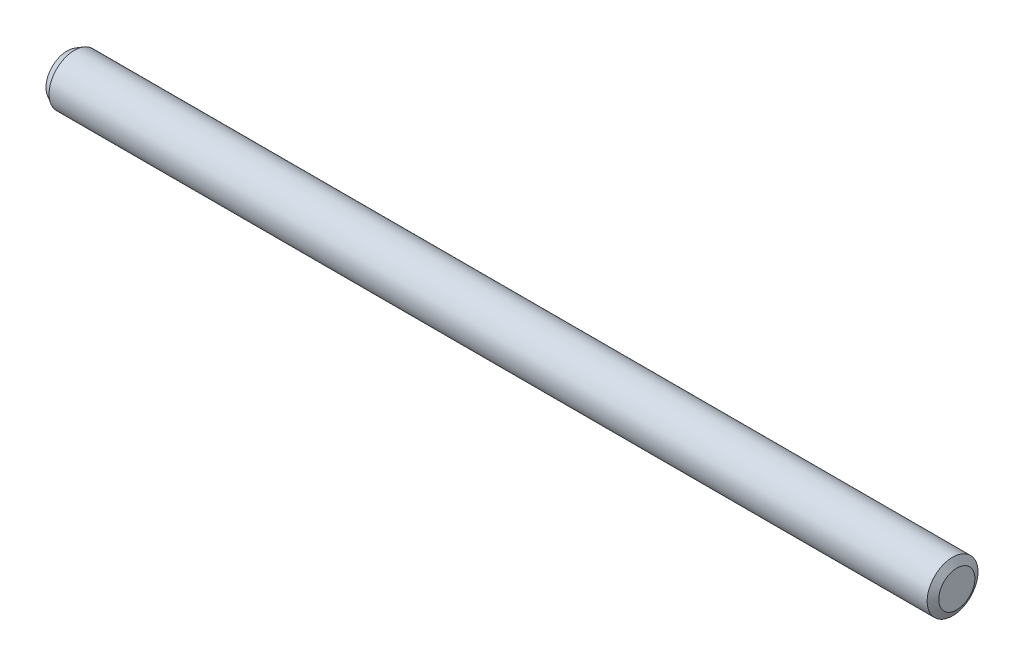
ISO-10303-21;
HEADER;
FILE_DESCRIPTION(('STEP AP214'),'2;1');
FILE_NAME('part.step','',(''),(''),'','','');
FILE_SCHEMA(('AUTOMOTIVE_DESIGN { 1 0 10303 214 1 1 1 1 }'));
ENDSEC;
DATA;
#1=APPLICATION_CONTEXT('core data for automotive mechanical design processes');
#2=APPLICATION_PROTOCOL_DEFINITION('international standard','automotive_design',2000,#1);
#3=PRODUCT_CONTEXT('',#1,'mechanical');
#4=PRODUCT('Part','Part','',(#3));
#5=PRODUCT_RELATED_PRODUCT_CATEGORY('part','',(#4));
#6=PRODUCT_DEFINITION_FORMATION('','',#4);
#7=PRODUCT_DEFINITION_CONTEXT('part definition',#1,'design');
#8=PRODUCT_DEFINITION('design','',#6,#7);
#9=PRODUCT_DEFINITION_SHAPE('','',#8);
#10=(LENGTH_UNIT() NAMED_UNIT(*) SI_UNIT(.MILLI.,.METRE.));
#11=(NAMED_UNIT(*) PLANE_ANGLE_UNIT() SI_UNIT($,.RADIAN.));
#12=(NAMED_UNIT(*) SI_UNIT($,.STERADIAN.) SOLID_ANGLE_UNIT());
#13=UNCERTAINTY_MEASURE_WITH_UNIT(LENGTH_MEASURE(1.E-05),#10,'distance_accuracy_value','');
#14=(GEOMETRIC_REPRESENTATION_CONTEXT(3) GLOBAL_UNCERTAINTY_ASSIGNED_CONTEXT((#13)) GLOBAL_UNIT_ASSIGNED_CONTEXT((#10,
#11,#12)) REPRESENTATION_CONTEXT('',''));
#15=CARTESIAN_POINT('',(0.,0.,0.));
#16=DIRECTION('',(0.,0.,1.));
#17=DIRECTION('',(1.,0.,0.));
#18=AXIS2_PLACEMENT_3D('',#15,#16,#17);
#19=CARTESIAN_POINT('',(52.5,0.,0.));
#20=DIRECTION('',(-1.,0.,0.));
#21=DIRECTION('',(0.,0.,1.));
#22=AXIS2_PLACEMENT_3D('',#19,#20,#21);
#23=CYLINDRICAL_SURFACE('',#22,3.);
#24=CARTESIAN_POINT('',(-51.6339745962156,0.,0.));
#25=DIRECTION('',(1.,0.,0.));
#26=DIRECTION('',(0.,0.,-1.));
#27=AXIS2_PLACEMENT_3D('',#24,#25,#26);
#28=CIRCLE('',#27,3.);
#29=CARTESIAN_POINT('',(-51.6339745962156,0.,-3.));
#30=VERTEX_POINT('',#29);
#31=EDGE_CURVE('E46',#30,#30,#28,.T.);
#32=ORIENTED_EDGE('',*,*,#31,.T.);
#33=EDGE_LOOP('',(#32));
#34=FACE_BOUND('',#33,.T.);
#35=CARTESIAN_POINT('',(52.,0.,0.));
#36=DIRECTION('',(1.,0.,0.));
#37=DIRECTION('',(0.,0.,-1.));
#38=AXIS2_PLACEMENT_3D('',#35,#36,#37);
#39=CIRCLE('',#38,3.);
#40=CARTESIAN_POINT('',(52.,0.,-3.));
#41=VERTEX_POINT('',#40);
#42=EDGE_CURVE('E50',#41,#41,#39,.F.);
#43=ORIENTED_EDGE('',*,*,#42,.T.);
#44=EDGE_LOOP('',(#43));
#45=FACE_BOUND('',#44,.T.);
#46=ADVANCED_FACE('F35',(#34,#45),#23,.T.);
#47=CARTESIAN_POINT('',(52.5,0.,0.));
#48=DIRECTION('',(1.,0.,0.));
#49=DIRECTION('',(0.,0.,-1.));
#50=AXIS2_PLACEMENT_3D('',#47,#48,#49);
#51=PLANE('',#50);
#52=CARTESIAN_POINT('',(52.5,0.,0.));
#53=DIRECTION('',(1.,0.,0.));
#54=DIRECTION('',(0.,0.,-1.));
#55=AXIS2_PLACEMENT_3D('',#52,#53,#54);
#56=CIRCLE('',#55,2.13397459621556);
#57=CARTESIAN_POINT('',(52.5,0.,-2.13397459621556));
#58=VERTEX_POINT('',#57);
#59=EDGE_CURVE('E10',#58,#58,#56,.T.);
#60=ORIENTED_EDGE('',*,*,#59,.T.);
#61=EDGE_LOOP('',(#60));
#62=FACE_BOUND('',#61,.T.);
#63=ADVANCED_FACE('F66',(#62),#51,.T.);
#64=CARTESIAN_POINT('',(-52.5,0.,0.));
#65=DIRECTION('',(1.,0.,0.));
#66=DIRECTION('',(0.,0.,-1.));
#67=AXIS2_PLACEMENT_3D('',#64,#65,#66);
#68=PLANE('',#67);
#69=CARTESIAN_POINT('',(-52.5,0.,0.));
#70=DIRECTION('',(1.,0.,0.));
#71=DIRECTION('',(0.,0.,-1.));
#72=AXIS2_PLACEMENT_3D('',#69,#70,#71);
#73=CIRCLE('',#72,2.50000000000002);
#74=CARTESIAN_POINT('',(-52.5,0.,-2.50000000000002));
#75=VERTEX_POINT('',#74);
#76=EDGE_CURVE('E42',#75,#75,#73,.F.);
#77=ORIENTED_EDGE('',*,*,#76,.T.);
#78=EDGE_LOOP('',(#77));
#79=FACE_BOUND('',#78,.T.);
#80=ADVANCED_FACE('F63',(#79),#68,.F.);
#81=CARTESIAN_POINT('',(-51.6339745962156,0.,0.));
#82=DIRECTION('',(1.,0.,0.));
#83=DIRECTION('',(0.,0.,-1.));
#84=AXIS2_PLACEMENT_3D('',#81,#82,#83);
#85=CONICAL_SURFACE('',#84,3.,0.523598775598298);
#86=ORIENTED_EDGE('',*,*,#76,.F.);
#87=EDGE_LOOP('',(#86));
#88=FACE_BOUND('',#87,.T.);
#89=ORIENTED_EDGE('',*,*,#31,.F.);
#90=EDGE_LOOP('',(#89));
#91=FACE_BOUND('',#90,.T.);
#92=ADVANCED_FACE('F59',(#88,#91),#85,.T.);
#93=CARTESIAN_POINT('',(52.5,0.,0.));
#94=DIRECTION('',(-1.,0.,0.));
#95=DIRECTION('',(0.,0.,1.));
#96=AXIS2_PLACEMENT_3D('',#93,#94,#95);
#97=CONICAL_SURFACE('',#96,2.13397459621556,1.04719755119659);
#98=ORIENTED_EDGE('',*,*,#42,.F.);
#99=EDGE_LOOP('',(#98));
#100=FACE_BOUND('',#99,.T.);
#101=ORIENTED_EDGE('',*,*,#59,.F.);
#102=EDGE_LOOP('',(#101));
#103=FACE_BOUND('',#102,.T.);
#104=ADVANCED_FACE('F37',(#100,#103),#97,.T.);
#105=CLOSED_SHELL('',(#46,#63,#80,#92,#104));
#106=MANIFOLD_SOLID_BREP('B2',#105);
#107=ADVANCED_BREP_SHAPE_REPRESENTATION('',(#18,#106),#14);
#108=SHAPE_DEFINITION_REPRESENTATION(#9,#107);
ENDSEC;
END-ISO-10303-21;
